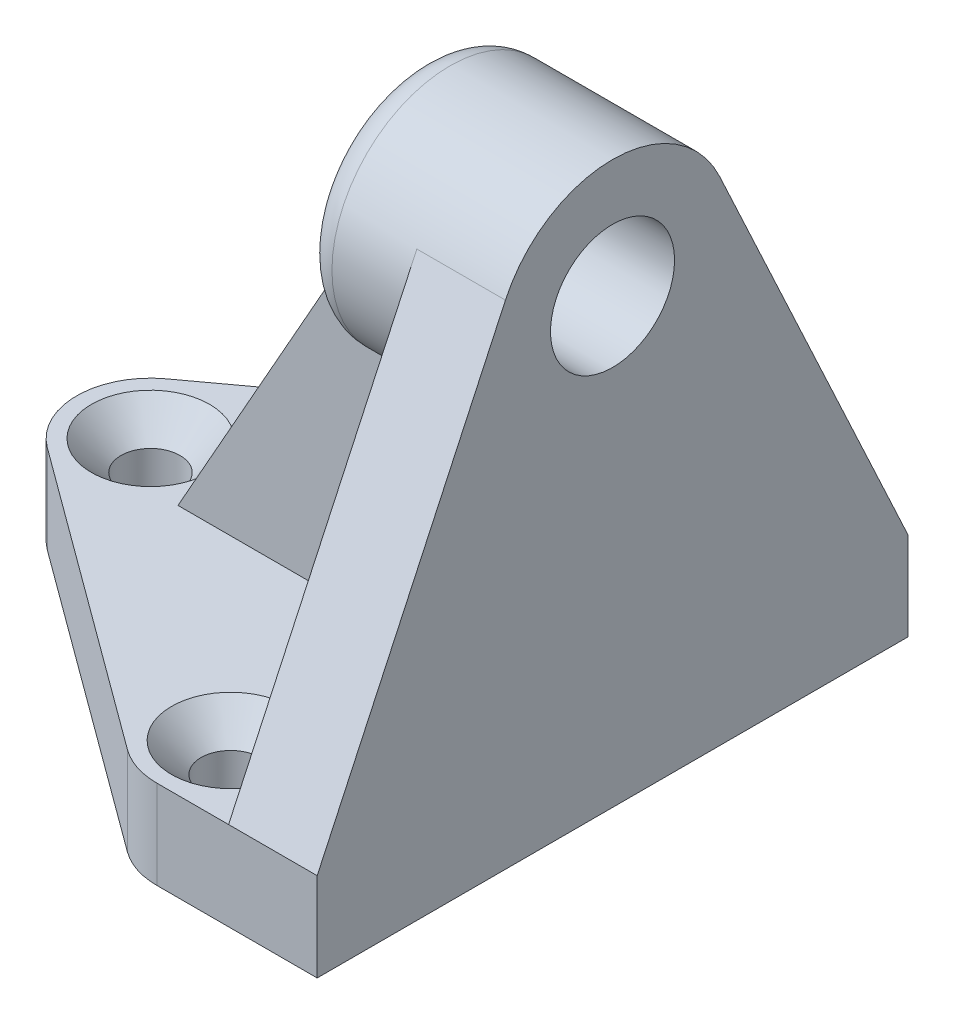
ISO-10303-21;
HEADER;
FILE_DESCRIPTION(('STEP AP214'),'2;1');
FILE_NAME('part.step','',(''),(''),'','','');
FILE_SCHEMA(('AUTOMOTIVE_DESIGN { 1 0 10303 214 1 1 1 1 }'));
ENDSEC;
DATA;
#1=APPLICATION_CONTEXT('core data for automotive mechanical design processes');
#2=APPLICATION_PROTOCOL_DEFINITION('international standard','automotive_design',2000,#1);
#3=PRODUCT_CONTEXT('',#1,'mechanical');
#4=PRODUCT('Part','Part','',(#3));
#5=PRODUCT_RELATED_PRODUCT_CATEGORY('part','',(#4));
#6=PRODUCT_DEFINITION_FORMATION('','',#4);
#7=PRODUCT_DEFINITION_CONTEXT('part definition',#1,'design');
#8=PRODUCT_DEFINITION('design','',#6,#7);
#9=PRODUCT_DEFINITION_SHAPE('','',#8);
#10=(LENGTH_UNIT() NAMED_UNIT(*) SI_UNIT(.MILLI.,.METRE.));
#11=(NAMED_UNIT(*) PLANE_ANGLE_UNIT() SI_UNIT($,.RADIAN.));
#12=(NAMED_UNIT(*) SI_UNIT($,.STERADIAN.) SOLID_ANGLE_UNIT());
#13=UNCERTAINTY_MEASURE_WITH_UNIT(LENGTH_MEASURE(1.E-05),#10,'distance_accuracy_value','');
#14=(GEOMETRIC_REPRESENTATION_CONTEXT(3) GLOBAL_UNCERTAINTY_ASSIGNED_CONTEXT((#13)) GLOBAL_UNIT_ASSIGNED_CONTEXT((#10,
#11,#12)) REPRESENTATION_CONTEXT('',''));
#15=CARTESIAN_POINT('',(0.,0.,0.));
#16=DIRECTION('',(0.,0.,1.));
#17=DIRECTION('',(1.,0.,0.));
#18=AXIS2_PLACEMENT_3D('',#15,#16,#17);
#19=CARTESIAN_POINT('',(-10.8612883527323,6.,15.));
#20=DIRECTION('',(0.,-1.,0.));
#21=DIRECTION('',(0.,0.,-1.));
#22=AXIS2_PLACEMENT_3D('',#19,#20,#21);
#23=PLANE('',#22);
#24=CARTESIAN_POINT('',(-10.8612883527323,6.,-15.));
#25=DIRECTION('',(0.,-1.,0.));
#26=DIRECTION('',(0.,0.,-1.));
#27=AXIS2_PLACEMENT_3D('',#24,#25,#26);
#28=CIRCLE('',#27,4.00000000000004);
#29=CARTESIAN_POINT('',(-10.8612883527323,6.,-19.));
#30=VERTEX_POINT('',#29);
#31=EDGE_CURVE('E372',#30,#30,#28,.T.);
#32=ORIENTED_EDGE('',*,*,#31,.T.);
#33=EDGE_LOOP('',(#32));
#34=FACE_BOUND('',#33,.T.);
#35=CARTESIAN_POINT('',(-31.2870516415162,6.,0.));
#36=DIRECTION('',(0.,-1.,0.));
#37=DIRECTION('',(0.,0.,-1.));
#38=AXIS2_PLACEMENT_3D('',#35,#36,#37);
#39=CIRCLE('',#38,4.00000000000005);
#40=CARTESIAN_POINT('',(-31.2870516415162,6.,-4.00000000000005));
#41=VERTEX_POINT('',#40);
#42=EDGE_CURVE('E376',#41,#41,#39,.T.);
#43=ORIENTED_EDGE('',*,*,#42,.T.);
#44=EDGE_LOOP('',(#43));
#45=FACE_BOUND('',#44,.T.);
#46=CARTESIAN_POINT('',(-10.8612883527323,6.,15.));
#47=DIRECTION('',(0.,-1.,0.));
#48=DIRECTION('',(0.,0.,-1.));
#49=AXIS2_PLACEMENT_3D('',#46,#47,#48);
#50=CIRCLE('',#49,4.00000000000004);
#51=CARTESIAN_POINT('',(-10.8612883527323,6.,11.));
#52=VERTEX_POINT('',#51);
#53=EDGE_CURVE('E380',#52,#52,#50,.T.);
#54=ORIENTED_EDGE('',*,*,#53,.T.);
#55=EDGE_LOOP('',(#54));
#56=FACE_BOUND('',#55,.T.);
#57=DIRECTION('',(1.,0.,0.));
#58=VECTOR('',#57,1.);
#59=CARTESIAN_POINT('',(-26.4270516415162,6.,-3.));
#60=LINE('',#59,#58);
#61=CARTESIAN_POINT('',(-26.4270516415162,6.,-3.));
#62=VERTEX_POINT('',#61);
#63=CARTESIAN_POINT('',(-6.,6.,-3.));
#64=VERTEX_POINT('',#63);
#65=EDGE_CURVE('E205',#62,#64,#60,.T.);
#66=ORIENTED_EDGE('',*,*,#65,.T.);
#67=DIRECTION('',(0.,0.,-1.));
#68=VECTOR('',#67,1.);
#69=CARTESIAN_POINT('',(-6.,6.,20.));
#70=LINE('',#69,#68);
#71=CARTESIAN_POINT('',(-6.,6.,-20.));
#72=VERTEX_POINT('',#71);
#73=EDGE_CURVE('E246',#64,#72,#70,.T.);
#74=ORIENTED_EDGE('',*,*,#73,.T.);
#75=DIRECTION('',(-1.,0.,0.));
#76=VECTOR('',#75,1.);
#77=CARTESIAN_POINT('',(0.,6.,-20.));
#78=LINE('',#77,#76);
#79=CARTESIAN_POINT('',(-10.8612883527323,6.,-20.));
#80=VERTEX_POINT('',#79);
#81=EDGE_CURVE('E292',#72,#80,#78,.T.);
#82=ORIENTED_EDGE('',*,*,#81,.T.);
#83=CARTESIAN_POINT('',(-10.8612883527323,6.,-15.));
#84=DIRECTION('',(0.,1.,0.));
#85=DIRECTION('',(0.,0.,1.));
#86=AXIS2_PLACEMENT_3D('',#83,#84,#85);
#87=CIRCLE('',#86,5.);
#88=CARTESIAN_POINT('',(-13.8208140882384,6.,-19.0300381413675));
#89=VERTEX_POINT('',#88);
#90=EDGE_CURVE('E298',#80,#89,#87,.T.);
#91=ORIENTED_EDGE('',*,*,#90,.T.);
#92=DIRECTION('',(-0.806007628273501,0.,0.591905147101228));
#93=VECTOR('',#92,1.);
#94=CARTESIAN_POINT('',(-34.2465773770223,6.,-4.0300381413675));
#95=LINE('',#94,#93);
#96=CARTESIAN_POINT('',(-34.2465773770223,6.,-4.0300381413675));
#97=VERTEX_POINT('',#96);
#98=EDGE_CURVE('E301',#89,#97,#95,.T.);
#99=ORIENTED_EDGE('',*,*,#98,.T.);
#100=CARTESIAN_POINT('',(-31.2870516415162,6.,0.));
#101=DIRECTION('',(0.,1.,0.));
#102=DIRECTION('',(0.,0.,1.));
#103=AXIS2_PLACEMENT_3D('',#100,#101,#102);
#104=CIRCLE('',#103,5.);
#105=CARTESIAN_POINT('',(-34.2465773770223,6.,4.03003814136751));
#106=VERTEX_POINT('',#105);
#107=EDGE_CURVE('E304',#97,#106,#104,.T.);
#108=ORIENTED_EDGE('',*,*,#107,.T.);
#109=DIRECTION('',(0.806007628273501,0.,0.591905147101228));
#110=VECTOR('',#109,1.);
#111=CARTESIAN_POINT('',(-34.2465773770223,6.,4.03003814136751));
#112=LINE('',#111,#110);
#113=CARTESIAN_POINT('',(-13.8208140882384,6.,19.0300381413675));
#114=VERTEX_POINT('',#113);
#115=EDGE_CURVE('E307',#106,#114,#112,.T.);
#116=ORIENTED_EDGE('',*,*,#115,.T.);
#117=CARTESIAN_POINT('',(-10.8612883527323,6.,15.));
#118=DIRECTION('',(0.,1.,0.));
#119=DIRECTION('',(0.,0.,-1.));
#120=AXIS2_PLACEMENT_3D('',#117,#118,#119);
#121=CIRCLE('',#120,5.);
#122=CARTESIAN_POINT('',(-10.8612883527323,6.,20.));
#123=VERTEX_POINT('',#122);
#124=EDGE_CURVE('E310',#114,#123,#121,.T.);
#125=ORIENTED_EDGE('',*,*,#124,.T.);
#126=DIRECTION('',(1.,0.,0.));
#127=VECTOR('',#126,1.);
#128=CARTESIAN_POINT('',(0.,6.,20.));
#129=LINE('',#128,#127);
#130=CARTESIAN_POINT('',(-6.,6.,20.));
#131=VERTEX_POINT('',#130);
#132=EDGE_CURVE('E288',#123,#131,#129,.T.);
#133=ORIENTED_EDGE('',*,*,#132,.T.);
#134=CARTESIAN_POINT('',(-6.,6.,3.));
#135=VERTEX_POINT('',#134);
#136=EDGE_CURVE('E248',#131,#135,#70,.T.);
#137=ORIENTED_EDGE('',*,*,#136,.T.);
#138=DIRECTION('',(1.,0.,0.));
#139=VECTOR('',#138,1.);
#140=CARTESIAN_POINT('',(-26.4270516415162,6.,3.));
#141=LINE('',#140,#139);
#142=CARTESIAN_POINT('',(-26.4270516415162,6.,3.));
#143=VERTEX_POINT('',#142);
#144=EDGE_CURVE('E66',#143,#135,#141,.T.);
#145=ORIENTED_EDGE('',*,*,#144,.F.);
#146=DIRECTION('',(0.,0.,1.));
#147=VECTOR('',#146,1.);
#148=CARTESIAN_POINT('',(-26.4270516415162,6.,-3.));
#149=LINE('',#148,#147);
#150=EDGE_CURVE('E195',#62,#143,#149,.T.);
#151=ORIENTED_EDGE('',*,*,#150,.F.);
#152=EDGE_LOOP('',(#66,#74,#82,#91,#99,#108,#116,#125,#133,#137,#145,#151));
#153=FACE_BOUND('',#152,.T.);
#154=ADVANCED_FACE('F49',(#34,#45,#56,#153),#23,.F.);
#155=CARTESIAN_POINT('',(-6.,30.,0.));
#156=DIRECTION('',(1.,0.,0.));
#157=DIRECTION('',(0.,0.,-1.));
#158=AXIS2_PLACEMENT_3D('',#155,#156,#157);
#159=PLANE('',#158);
#160=DIRECTION('',(0.,-1.,0.));
#161=VECTOR('',#160,1.);
#162=CARTESIAN_POINT('',(-6.,30.,-3.));
#163=LINE('',#162,#161);
#164=CARTESIAN_POINT('',(-6.,17.734425211105,-3.));
#165=VERTEX_POINT('',#164);
#166=EDGE_CURVE('E230',#165,#64,#163,.T.);
#167=ORIENTED_EDGE('',*,*,#166,.F.);
#168=DIRECTION('',(0.,0.,1.));
#169=VECTOR('',#168,1.);
#170=CARTESIAN_POINT('',(-6.,17.734425211105,0.));
#171=LINE('',#170,#169);
#172=CARTESIAN_POINT('',(-6.,17.734425211105,3.));
#173=VERTEX_POINT('',#172);
#174=EDGE_CURVE('E11',#165,#173,#171,.T.);
#175=ORIENTED_EDGE('',*,*,#174,.T.);
#176=DIRECTION('',(0.,-1.,0.));
#177=VECTOR('',#176,1.);
#178=CARTESIAN_POINT('',(-6.,30.,3.));
#179=LINE('',#178,#177);
#180=EDGE_CURVE('E182',#173,#135,#179,.T.);
#181=ORIENTED_EDGE('',*,*,#180,.T.);
#182=ORIENTED_EDGE('',*,*,#136,.F.);
#183=DIRECTION('',(0.,-0.906541091993844,0.422117576661537));
#184=VECTOR('',#183,1.);
#185=CARTESIAN_POINT('',(-6.,33.3769406132923,7.25232873595075));
#186=LINE('',#185,#184);
#187=CARTESIAN_POINT('',(-6.,33.3769406132923,7.25232873595075));
#188=VERTEX_POINT('',#187);
#189=EDGE_CURVE('E242',#188,#131,#186,.T.);
#190=ORIENTED_EDGE('',*,*,#189,.F.);
#191=CARTESIAN_POINT('',(-6.,30.,0.));
#192=DIRECTION('',(-1.,0.,0.));
#193=DIRECTION('',(0.,0.,1.));
#194=AXIS2_PLACEMENT_3D('',#191,#192,#193);
#195=CIRCLE('',#194,7.99999999999999);
#196=CARTESIAN_POINT('',(-6.,33.3769406132923,-7.25232873595075));
#197=VERTEX_POINT('',#196);
#198=EDGE_CURVE('E233',#197,#188,#195,.T.);
#199=ORIENTED_EDGE('',*,*,#198,.F.);
#200=DIRECTION('',(0.,0.906541091993844,0.422117576661537));
#201=VECTOR('',#200,1.);
#202=CARTESIAN_POINT('',(-6.,33.3769406132923,-7.25232873595075));
#203=LINE('',#202,#201);
#204=EDGE_CURVE('E252',#72,#197,#203,.T.);
#205=ORIENTED_EDGE('',*,*,#204,.F.);
#206=ORIENTED_EDGE('',*,*,#73,.F.);
#207=EDGE_LOOP('',(#167,#175,#181,#182,#190,#199,#205,#206));
#208=FACE_BOUND('',#207,.T.);
#209=ADVANCED_FACE('F461',(#208),#159,.F.);
#210=CARTESIAN_POINT('',(-13.,30.,0.));
#211=DIRECTION('',(-1.,0.,0.));
#212=DIRECTION('',(0.,0.,1.));
#213=AXIS2_PLACEMENT_3D('',#210,#211,#212);
#214=PLANE('',#213);
#215=CARTESIAN_POINT('',(-13.,30.,0.));
#216=DIRECTION('',(-1.,0.,0.));
#217=DIRECTION('',(0.,0.,1.));
#218=AXIS2_PLACEMENT_3D('',#215,#216,#217);
#219=CIRCLE('',#218,6.);
#220=CARTESIAN_POINT('',(-13.,24.8038475772934,3.));
#221=VERTEX_POINT('',#220);
#222=CARTESIAN_POINT('',(-13.,24.8038475772934,-3.));
#223=VERTEX_POINT('',#222);
#224=EDGE_CURVE('E392',#221,#223,#219,.T.);
#225=ORIENTED_EDGE('',*,*,#224,.T.);
#226=DIRECTION('',(0.,1.,0.));
#227=VECTOR('',#226,1.);
#228=CARTESIAN_POINT('',(-13.,30.,-3.));
#229=LINE('',#228,#227);
#230=CARTESIAN_POINT('',(-13.,29.7902541311326,-3.));
#231=VERTEX_POINT('',#230);
#232=EDGE_CURVE('E74',#223,#231,#229,.T.);
#233=ORIENTED_EDGE('',*,*,#232,.T.);
#234=DIRECTION('',(0.,0.,-1.));
#235=VECTOR('',#234,1.);
#236=CARTESIAN_POINT('',(-13.,29.7902541311326,0.));
#237=LINE('',#236,#235);
#238=CARTESIAN_POINT('',(-13.,29.7902541311326,3.));
#239=VERTEX_POINT('',#238);
#240=EDGE_CURVE('E59',#239,#231,#237,.T.);
#241=ORIENTED_EDGE('',*,*,#240,.F.);
#242=DIRECTION('',(0.,1.,0.));
#243=VECTOR('',#242,1.);
#244=CARTESIAN_POINT('',(-13.,30.,3.));
#245=LINE('',#244,#243);
#246=EDGE_CURVE('E221',#221,#239,#245,.T.);
#247=ORIENTED_EDGE('',*,*,#246,.F.);
#248=EDGE_LOOP('',(#225,#233,#241,#247));
#249=FACE_BOUND('',#248,.T.);
#250=ADVANCED_FACE('F468',(#249),#214,.T.);
#251=CARTESIAN_POINT('',(-11.,30.,0.));
#252=DIRECTION('',(-1.,0.,0.));
#253=DIRECTION('',(0.,0.,1.));
#254=AXIS2_PLACEMENT_3D('',#251,#252,#253);
#255=TOROIDAL_SURFACE('',#254,6.,2.);
#256=CARTESIAN_POINT('',(-11.,30.,0.));
#257=DIRECTION('',(-1.,0.,0.));
#258=DIRECTION('',(0.,0.,1.));
#259=AXIS2_PLACEMENT_3D('',#256,#257,#258);
#260=CIRCLE('',#259,8.);
#261=CARTESIAN_POINT('',(-11.,30.,8.));
#262=VERTEX_POINT('',#261);
#263=EDGE_CURVE('E395',#262,#262,#260,.F.);
#264=ORIENTED_EDGE('',*,*,#263,.F.);
#265=EDGE_LOOP('',(#264));
#266=FACE_BOUND('',#265,.T.);
#267=CARTESIAN_POINT('',(-11.5302837937611,30.,0.));
#268=DIRECTION('',(1.,0.,0.));
#269=DIRECTION('',(0.,0.,-1.));
#270=AXIS2_PLACEMENT_3D('',#267,#268,#269);
#271=CIRCLE('',#270,7.9284188077475);
#272=CARTESIAN_POINT('',(-11.5302837937611,22.6610746841895,-3.));
#273=VERTEX_POINT('',#272);
#274=CARTESIAN_POINT('',(-11.5302837937611,22.6610746841895,3.));
#275=VERTEX_POINT('',#274);
#276=EDGE_CURVE('E200',#273,#275,#271,.F.);
#277=ORIENTED_EDGE('',*,*,#276,.F.);
#278=CARTESIAN_POINT('',(-11.861235789251,22.7945092467716,-3.));
#279=CARTESIAN_POINT('',(-11.9623192033776,22.8467587869637,-3.));
#280=CARTESIAN_POINT('',(-12.0588170115225,22.9080491003356,-3.));
#281=CARTESIAN_POINT('',(-12.239920791373,23.0463176561553,-3.));
#282=CARTESIAN_POINT('',(-12.3245102394087,23.1233173408038,-3.));
#283=CARTESIAN_POINT('',(-12.4795153231167,23.2899126004749,-3.));
#284=CARTESIAN_POINT('',(-12.5499797407544,23.3794629436575,-3.));
#285=CARTESIAN_POINT('',(-12.6758968205651,23.5684784426451,-3.));
#286=CARTESIAN_POINT('',(-12.7313517649318,23.66794208798,-3.));
#287=CARTESIAN_POINT('',(-12.8297652546317,23.8806070096931,-3.));
#288=CARTESIAN_POINT('',(-12.8717015104087,23.9942798482262,-3.));
#289=CARTESIAN_POINT('',(-12.937967977474,24.2266318668024,-3.));
#290=CARTESIAN_POINT('',(-12.9622900628024,24.3453133307947,-3.));
#291=CARTESIAN_POINT('',(-12.9954923838156,24.5980248776064,-3.));
#292=CARTESIAN_POINT('',(-13.0023930414501,24.7323141143187,-3.));
#293=CARTESIAN_POINT('',(-12.9961464350172,25.0003748589907,-3.));
#294=CARTESIAN_POINT('',(-12.9829938887939,25.1341462212328,-3.));
#295=CARTESIAN_POINT('',(-12.9351808058057,25.414552635414,-3.));
#296=CARTESIAN_POINT('',(-12.8981025036533,25.5607772469715,-3.));
#297=CARTESIAN_POINT('',(-12.8020918204387,25.8460234128724,-3.));
#298=CARTESIAN_POINT('',(-12.7431253113263,25.9850333302221,-3.));
#299=CARTESIAN_POINT('',(-12.5980816696745,26.2654035867372,-3.));
#300=CARTESIAN_POINT('',(-12.5099570181412,26.4057263090478,-3.));
#301=CARTESIAN_POINT('',(-12.3602840182229,26.6026043339008,-3.));
#302=CARTESIAN_POINT('',(-12.3074935598185,26.6659489906292,-3.));
#303=CARTESIAN_POINT('',(-12.1960670269366,26.7872421336792,-3.));
#304=CARTESIAN_POINT('',(-12.1374349295262,26.845194240038,-3.));
#305=CARTESIAN_POINT('',(-12.0019032751842,26.9655505348394,-3.));
#306=CARTESIAN_POINT('',(-11.9237006805427,27.0265085307263,-3.));
#307=CARTESIAN_POINT('',(-11.7590515498349,27.1359722592255,-3.));
#308=CARTESIAN_POINT('',(-11.6726208257878,27.1845012396234,-3.));
#309=CARTESIAN_POINT('',(-11.5092958412461,27.2577199413555,-3.));
#310=CARTESIAN_POINT('',(-11.4336551120478,27.2851741747413,-3.));
#311=CARTESIAN_POINT('',(-11.2788523710753,27.3270980880797,-3.));
#312=CARTESIAN_POINT('',(-11.1996943375117,27.3415820643396,-3.));
#313=CARTESIAN_POINT('',(-11.0396666774527,27.3560843518458,-3.));
#314=CARTESIAN_POINT('',(-10.9587909316809,27.3560369808088,-3.));
#315=CARTESIAN_POINT('',(-10.7983792007026,27.3413131196877,-3.));
#316=CARTESIAN_POINT('',(-10.7188438866461,27.3266295103347,-3.));
#317=CARTESIAN_POINT('',(-10.568094656578,27.2854963485297,-3.));
#318=CARTESIAN_POINT('',(-10.4966678097853,27.2598059005786,-3.));
#319=CARTESIAN_POINT('',(-10.3580995795439,27.1987833045736,-3.));
#320=CARTESIAN_POINT('',(-10.2909605419162,27.1634459335996,-3.));
#321=CARTESIAN_POINT('',(-10.1222106933377,27.06114109854,-3.));
#322=CARTESIAN_POINT('',(-10.0243506841569,26.9879793313313,-3.));
#323=CARTESIAN_POINT('',(-9.84131955467087,26.827134059973,-3.));
#324=CARTESIAN_POINT('',(-9.75618549008205,26.7394096593078,-3.));
#325=CARTESIAN_POINT('',(-9.57405244583853,26.523987225174,-3.));
#326=CARTESIAN_POINT('',(-9.48167763293907,26.392370773904,-3.));
#327=CARTESIAN_POINT('',(-9.31967946905861,26.1159483800208,-3.));
#328=CARTESIAN_POINT('',(-9.25005871913124,25.9711409319411,-3.));
#329=CARTESIAN_POINT('',(-9.13457148779452,25.6709876084404,-3.));
#330=CARTESIAN_POINT('',(-9.08889609273097,25.5155678216416,-3.));
#331=CARTESIAN_POINT('',(-9.02431185205182,25.1992234422896,-3.));
#332=CARTESIAN_POINT('',(-9.00539707930456,25.0383000767972,-3.));
#333=CARTESIAN_POINT('',(-8.99660949287456,24.7159375897862,-3.));
#334=CARTESIAN_POINT('',(-9.00666714905949,24.5545006302594,-3.));
#335=CARTESIAN_POINT('',(-9.05754894071875,24.2364674822837,-3.));
#336=CARTESIAN_POINT('',(-9.09835223290371,24.0798680891563,-3.));
#337=CARTESIAN_POINT('',(-9.20461256792815,23.7964258070394,-3.));
#338=CARTESIAN_POINT('',(-9.26654101126687,23.6682632486085,-3.));
#339=CARTESIAN_POINT('',(-9.41407342760088,23.4263540293851,-3.));
#340=CARTESIAN_POINT('',(-9.49965348883765,23.3125929771653,-3.));
#341=CARTESIAN_POINT('',(-9.67988329245463,23.1183462818847,-3.));
#342=CARTESIAN_POINT('',(-9.77195369467014,23.0354631000641,-3.));
#343=CARTESIAN_POINT('',(-9.96992695678342,22.8882976013662,-3.));
#344=CARTESIAN_POINT('',(-10.0758199717786,22.8240021495129,-3.));
#345=CARTESIAN_POINT('',(-10.2874439529942,22.7220353114017,-3.));
#346=CARTESIAN_POINT('',(-10.3922412414086,22.6824196942582,-3.));
#347=CARTESIAN_POINT('',(-10.6072256587107,22.6224372505113,-3.));
#348=CARTESIAN_POINT('',(-10.7174117144998,22.6020666078208,-3.));
#349=CARTESIAN_POINT('',(-10.9338337111218,22.5819651643408,-3.));
#350=CARTESIAN_POINT('',(-11.0399766666559,22.5812150696034,-3.));
#351=CARTESIAN_POINT('',(-11.2507649871095,22.59780178098,-3.));
#352=CARTESIAN_POINT('',(-11.3554117837475,22.6151199328209,-3.));
#353=CARTESIAN_POINT('',(-11.5276838082517,22.6588542563716,-3.));
#354=CARTESIAN_POINT('',(-11.5965231723444,22.6806420694349,-3.));
#355=CARTESIAN_POINT('',(-11.7312675484523,22.7319126261557,-3.));
#356=CARTESIAN_POINT('',(-11.7971725935773,22.7613952829615,-3.));
#357=CARTESIAN_POINT('',(-11.861235789251,22.7945092467716,-3.));
#358=B_SPLINE_CURVE_WITH_KNOTS('',3,(#278,#279,#280,#281,#282,#283,#284,#285,#286,#287,#288,
#289,#290,#291,#292,#293,#294,#295,#296,#297,#298,#299,#300,#301,#302,#303,#304,#305,#306,#307,
#308,#309,#310,#311,#312,#313,#314,#315,#316,#317,#318,#319,#320,#321,#322,#323,#324,#325,#326,
#327,#328,#329,#330,#331,#332,#333,#334,#335,#336,#337,#338,#339,#340,#341,#342,#343,#344,#345,
#346,#347,#348,#349,#350,#351,#352,#353,#354,#355,#356,#357),.UNSPECIFIED.,.T.,.F.,(4,2,2,2,2,2,
2,2,2,2,2,2,2,2,2,2,2,2,2,2,2,2,2,2,2,2,2,2,2,2,2,2,2,2,2,2,2,2,2,4),(0.,0.341082634042776,
0.68263397484685,1.02298460833743,1.36328346232843,1.72528109436704,2.087445620873,
2.48921601915108,2.89109226488007,3.34176807126643,3.79314954250234,4.28753105367206,
4.53460233901777,4.78150654960585,5.07803507370419,5.37400483885166,5.61444098456028,
5.85461178509525,6.09586818338414,6.33724198941945,6.56412824779699,6.79113758863312,
7.15564110474831,7.52118613902019,8.00112370161543,8.48111610747457,8.96488273430926,
9.44854219631143,9.93104190503539,10.413214808255,10.8377709213133,11.2618993689812,
11.6315168427333,12.0008724851369,12.3352619260114,12.6695850468572,12.9865034291092,
13.3030949375122,13.5192638346241,13.7354302919447),.UNSPECIFIED.);
#359=EDGE_CURVE('E419',#273,#223,#358,.T.);
#360=ORIENTED_EDGE('',*,*,#359,.T.);
#361=ORIENTED_EDGE('',*,*,#224,.F.);
#362=CARTESIAN_POINT('',(-11.861235789251,22.7945092467716,3.));
#363=CARTESIAN_POINT('',(-11.9623192033776,22.8467587869637,3.));
#364=CARTESIAN_POINT('',(-12.0588170115225,22.9080491003356,3.));
#365=CARTESIAN_POINT('',(-12.2399207913731,23.0463176561553,3.));
#366=CARTESIAN_POINT('',(-12.3245102394087,23.1233173408038,3.));
#367=CARTESIAN_POINT('',(-12.4795153231167,23.2899126004749,3.));
#368=CARTESIAN_POINT('',(-12.5499797407544,23.3794629436575,3.));
#369=CARTESIAN_POINT('',(-12.6758968205651,23.5684784426451,3.));
#370=CARTESIAN_POINT('',(-12.7313517649318,23.66794208798,3.));
#371=CARTESIAN_POINT('',(-12.8297652546317,23.8806070096931,3.));
#372=CARTESIAN_POINT('',(-12.8717015104087,23.9942798482262,3.));
#373=CARTESIAN_POINT('',(-12.937967977474,24.2266318668024,3.));
#374=CARTESIAN_POINT('',(-12.9622900628024,24.3453133307947,3.));
#375=CARTESIAN_POINT('',(-12.9954923838156,24.5980248776064,3.));
#376=CARTESIAN_POINT('',(-13.0023930414501,24.7323141143187,3.));
#377=CARTESIAN_POINT('',(-12.9961464350172,25.0003748589907,3.));
#378=CARTESIAN_POINT('',(-12.9829938887939,25.1341462212328,3.));
#379=CARTESIAN_POINT('',(-12.9351808058057,25.414552635414,3.));
#380=CARTESIAN_POINT('',(-12.8981025036533,25.5607772469715,3.));
#381=CARTESIAN_POINT('',(-12.8020918204387,25.8460234128724,3.));
#382=CARTESIAN_POINT('',(-12.7431253113263,25.9850333302221,3.));
#383=CARTESIAN_POINT('',(-12.5980816696745,26.2654035867372,3.));
#384=CARTESIAN_POINT('',(-12.5099570181412,26.4057263090478,3.));
#385=CARTESIAN_POINT('',(-12.3602840182229,26.6026043339008,3.));
#386=CARTESIAN_POINT('',(-12.3074935598185,26.6659489906292,3.));
#387=CARTESIAN_POINT('',(-12.1960670269366,26.7872421336792,3.));
#388=CARTESIAN_POINT('',(-12.1374349295262,26.845194240038,3.));
#389=CARTESIAN_POINT('',(-12.0019032751842,26.9655505348394,3.));
#390=CARTESIAN_POINT('',(-11.9237006805427,27.0265085307263,3.));
#391=CARTESIAN_POINT('',(-11.7590515498349,27.1359722592255,3.));
#392=CARTESIAN_POINT('',(-11.6726208257878,27.1845012396234,3.));
#393=CARTESIAN_POINT('',(-11.5092958412461,27.2577199413555,3.));
#394=CARTESIAN_POINT('',(-11.4336551120478,27.2851741747413,3.));
#395=CARTESIAN_POINT('',(-11.2788523710753,27.3270980880797,3.));
#396=CARTESIAN_POINT('',(-11.1996943375117,27.3415820643396,3.));
#397=CARTESIAN_POINT('',(-11.0396666774527,27.3560843518458,3.));
#398=CARTESIAN_POINT('',(-10.9587909316809,27.3560369808088,3.));
#399=CARTESIAN_POINT('',(-10.7983792007026,27.3413131196877,3.));
#400=CARTESIAN_POINT('',(-10.7188438866461,27.3266295103347,3.));
#401=CARTESIAN_POINT('',(-10.568094656578,27.2854963485297,3.));
#402=CARTESIAN_POINT('',(-10.4966678097853,27.2598059005786,3.));
#403=CARTESIAN_POINT('',(-10.3580995795439,27.1987833045736,3.));
#404=CARTESIAN_POINT('',(-10.2909605419162,27.1634459335996,3.));
#405=CARTESIAN_POINT('',(-10.1222106933377,27.06114109854,3.));
#406=CARTESIAN_POINT('',(-10.0243506841569,26.9879793313313,3.));
#407=CARTESIAN_POINT('',(-9.84131955467087,26.827134059973,3.));
#408=CARTESIAN_POINT('',(-9.75618549008204,26.7394096593078,3.));
#409=CARTESIAN_POINT('',(-9.57405244583852,26.523987225174,3.));
#410=CARTESIAN_POINT('',(-9.48167763293906,26.392370773904,3.));
#411=CARTESIAN_POINT('',(-9.3196794690586,26.1159483800207,3.));
#412=CARTESIAN_POINT('',(-9.25005871913124,25.971140931941,3.));
#413=CARTESIAN_POINT('',(-9.13457148779452,25.6709876084404,3.));
#414=CARTESIAN_POINT('',(-9.08889609273097,25.5155678216416,3.));
#415=CARTESIAN_POINT('',(-9.02431185205181,25.1992234422896,3.));
#416=CARTESIAN_POINT('',(-9.00539707930456,25.0383000767972,3.));
#417=CARTESIAN_POINT('',(-8.99660949287456,24.7159375897862,3.));
#418=CARTESIAN_POINT('',(-9.00666714905949,24.5545006302594,3.));
#419=CARTESIAN_POINT('',(-9.05754894071876,24.2364674822836,3.));
#420=CARTESIAN_POINT('',(-9.09835223290371,24.0798680891563,3.));
#421=CARTESIAN_POINT('',(-9.20461256792816,23.7964258070394,3.));
#422=CARTESIAN_POINT('',(-9.26654101126688,23.6682632486085,3.));
#423=CARTESIAN_POINT('',(-9.41407342760088,23.4263540293851,3.));
#424=CARTESIAN_POINT('',(-9.49965348883766,23.3125929771653,3.));
#425=CARTESIAN_POINT('',(-9.67988329245463,23.1183462818847,3.));
#426=CARTESIAN_POINT('',(-9.77195369467014,23.0354631000641,3.));
#427=CARTESIAN_POINT('',(-9.96992695678342,22.8882976013662,3.));
#428=CARTESIAN_POINT('',(-10.0758199717786,22.8240021495129,3.));
#429=CARTESIAN_POINT('',(-10.2874439529942,22.7220353114017,3.));
#430=CARTESIAN_POINT('',(-10.3922412414086,22.6824196942582,3.));
#431=CARTESIAN_POINT('',(-10.6072256587107,22.6224372505113,3.));
#432=CARTESIAN_POINT('',(-10.7174117144998,22.6020666078208,3.));
#433=CARTESIAN_POINT('',(-10.9338337111218,22.5819651643408,3.));
#434=CARTESIAN_POINT('',(-11.0399766666559,22.5812150696034,3.));
#435=CARTESIAN_POINT('',(-11.2507649871095,22.59780178098,3.));
#436=CARTESIAN_POINT('',(-11.3554117837475,22.6151199328209,3.));
#437=CARTESIAN_POINT('',(-11.5276838082517,22.6588542563716,3.));
#438=CARTESIAN_POINT('',(-11.5965231723444,22.6806420694349,3.));
#439=CARTESIAN_POINT('',(-11.7312675484523,22.7319126261557,3.));
#440=CARTESIAN_POINT('',(-11.7971725935773,22.7613952829615,3.));
#441=CARTESIAN_POINT('',(-11.861235789251,22.7945092467716,3.));
#442=B_SPLINE_CURVE_WITH_KNOTS('',3,(#362,#363,#364,#365,#366,#367,#368,#369,#370,#371,#372,
#373,#374,#375,#376,#377,#378,#379,#380,#381,#382,#383,#384,#385,#386,#387,#388,#389,#390,#391,
#392,#393,#394,#395,#396,#397,#398,#399,#400,#401,#402,#403,#404,#405,#406,#407,#408,#409,#410,
#411,#412,#413,#414,#415,#416,#417,#418,#419,#420,#421,#422,#423,#424,#425,#426,#427,#428,#429,
#430,#431,#432,#433,#434,#435,#436,#437,#438,#439,#440,#441),.UNSPECIFIED.,.T.,.F.,(4,2,2,2,2,2,
2,2,2,2,2,2,2,2,2,2,2,2,2,2,2,2,2,2,2,2,2,2,2,2,2,2,2,2,2,2,2,2,2,4),(0.,0.341082634042779,
0.682633974846849,1.02298460833742,1.36328346232843,1.72528109436704,2.087445620873,
2.48921601915108,2.89109226488007,3.34176807126643,3.79314954250235,4.28753105367206,
4.53460233901777,4.78150654960585,5.07803507370419,5.37400483885166,5.61444098456028,
5.85461178509525,6.09586818338414,6.33724198941945,6.564128247797,6.79113758863312,
7.15564110474832,7.5211861390202,8.00112370161544,8.48111610747457,8.96488273430926,
9.44854219631143,9.9310419050354,10.413214808255,10.8377709213133,11.2618993689812,
11.6315168427333,12.0008724851369,12.3352619260114,12.6695850468572,12.9865034291092,
13.3030949375122,13.5192638346241,13.7354302919447),.UNSPECIFIED.);
#443=EDGE_CURVE('E399',#275,#221,#442,.T.);
#444=ORIENTED_EDGE('',*,*,#443,.F.);
#445=EDGE_LOOP('',(#277,#360,#361,#444));
#446=FACE_BOUND('',#445,.T.);
#447=ADVANCED_FACE('F51',(#266,#446),#255,.T.);
#448=CARTESIAN_POINT('',(-10.8612883527323,0.,15.));
#449=DIRECTION('',(0.,-1.,0.));
#450=DIRECTION('',(0.,0.,-1.));
#451=AXIS2_PLACEMENT_3D('',#448,#449,#450);
#452=PLANE('',#451);
#453=CARTESIAN_POINT('',(-31.2870516415162,0.,0.));
#454=DIRECTION('',(0.,1.,0.));
#455=DIRECTION('',(0.,0.,1.));
#456=AXIS2_PLACEMENT_3D('',#453,#454,#455);
#457=CIRCLE('',#456,2.);
#458=CARTESIAN_POINT('',(-31.2870516415162,0.,2.00000000000001));
#459=VERTEX_POINT('',#458);
#460=EDGE_CURVE('E279',#459,#459,#457,.T.);
#461=ORIENTED_EDGE('',*,*,#460,.T.);
#462=EDGE_LOOP('',(#461));
#463=FACE_BOUND('',#462,.T.);
#464=DIRECTION('',(1.,0.,0.));
#465=VECTOR('',#464,1.);
#466=CARTESIAN_POINT('',(0.,0.,20.));
#467=LINE('',#466,#465);
#468=CARTESIAN_POINT('',(-10.8612883527323,0.,20.));
#469=VERTEX_POINT('',#468);
#470=CARTESIAN_POINT('',(0.,0.,20.));
#471=VERTEX_POINT('',#470);
#472=EDGE_CURVE('E287',#469,#471,#467,.T.);
#473=ORIENTED_EDGE('',*,*,#472,.F.);
#474=CARTESIAN_POINT('',(-10.8612883527323,0.,15.));
#475=DIRECTION('',(0.,1.,0.));
#476=DIRECTION('',(0.,0.,-1.));
#477=AXIS2_PLACEMENT_3D('',#474,#475,#476);
#478=CIRCLE('',#477,5.);
#479=CARTESIAN_POINT('',(-13.8208140882384,0.,19.0300381413675));
#480=VERTEX_POINT('',#479);
#481=EDGE_CURVE('E293',#480,#469,#478,.T.);
#482=ORIENTED_EDGE('',*,*,#481,.F.);
#483=DIRECTION('',(0.806007628273501,0.,0.591905147101228));
#484=VECTOR('',#483,1.);
#485=CARTESIAN_POINT('',(-34.2465773770223,0.,4.03003814136751));
#486=LINE('',#485,#484);
#487=CARTESIAN_POINT('',(-34.2465773770223,0.,4.03003814136751));
#488=VERTEX_POINT('',#487);
#489=EDGE_CURVE('E332',#488,#480,#486,.T.);
#490=ORIENTED_EDGE('',*,*,#489,.F.);
#491=CARTESIAN_POINT('',(-31.2870516415162,0.,0.));
#492=DIRECTION('',(0.,1.,0.));
#493=DIRECTION('',(0.,0.,1.));
#494=AXIS2_PLACEMENT_3D('',#491,#492,#493);
#495=CIRCLE('',#494,5.);
#496=CARTESIAN_POINT('',(-34.2465773770223,0.,-4.0300381413675));
#497=VERTEX_POINT('',#496);
#498=EDGE_CURVE('E329',#497,#488,#495,.T.);
#499=ORIENTED_EDGE('',*,*,#498,.F.);
#500=DIRECTION('',(-0.806007628273501,0.,0.591905147101228));
#501=VECTOR('',#500,1.);
#502=CARTESIAN_POINT('',(-34.2465773770223,0.,-4.0300381413675));
#503=LINE('',#502,#501);
#504=CARTESIAN_POINT('',(-13.8208140882384,0.,-19.0300381413675));
#505=VERTEX_POINT('',#504);
#506=EDGE_CURVE('E326',#505,#497,#503,.T.);
#507=ORIENTED_EDGE('',*,*,#506,.F.);
#508=CARTESIAN_POINT('',(-10.8612883527323,0.,-15.));
#509=DIRECTION('',(0.,1.,0.));
#510=DIRECTION('',(0.,0.,1.));
#511=AXIS2_PLACEMENT_3D('',#508,#509,#510);
#512=CIRCLE('',#511,5.);
#513=CARTESIAN_POINT('',(-10.8612883527323,0.,-20.));
#514=VERTEX_POINT('',#513);
#515=EDGE_CURVE('E323',#514,#505,#512,.T.);
#516=ORIENTED_EDGE('',*,*,#515,.F.);
#517=DIRECTION('',(-1.,0.,0.));
#518=VECTOR('',#517,1.);
#519=CARTESIAN_POINT('',(0.,0.,-20.));
#520=LINE('',#519,#518);
#521=CARTESIAN_POINT('',(0.,0.,-20.));
#522=VERTEX_POINT('',#521);
#523=EDGE_CURVE('E320',#522,#514,#520,.T.);
#524=ORIENTED_EDGE('',*,*,#523,.F.);
#525=DIRECTION('',(0.,0.,-1.));
#526=VECTOR('',#525,1.);
#527=CARTESIAN_POINT('',(0.,0.,20.));
#528=LINE('',#527,#526);
#529=EDGE_CURVE('E317',#471,#522,#528,.T.);
#530=ORIENTED_EDGE('',*,*,#529,.F.);
#531=EDGE_LOOP('',(#473,#482,#490,#499,#507,#516,#524,#530));
#532=FACE_BOUND('',#531,.T.);
#533=CARTESIAN_POINT('',(-10.8612883527323,0.,-15.));
#534=DIRECTION('',(0.,1.,0.));
#535=DIRECTION('',(0.,0.,1.));
#536=AXIS2_PLACEMENT_3D('',#533,#534,#535);
#537=CIRCLE('',#536,2.);
#538=CARTESIAN_POINT('',(-10.8612883527323,0.,-13.));
#539=VERTEX_POINT('',#538);
#540=EDGE_CURVE('E283',#539,#539,#537,.T.);
#541=ORIENTED_EDGE('',*,*,#540,.T.);
#542=EDGE_LOOP('',(#541));
#543=FACE_BOUND('',#542,.T.);
#544=CARTESIAN_POINT('',(-10.8612883527323,0.,15.));
#545=DIRECTION('',(0.,1.,0.));
#546=DIRECTION('',(0.,0.,1.));
#547=AXIS2_PLACEMENT_3D('',#544,#545,#546);
#548=CIRCLE('',#547,2.);
#549=CARTESIAN_POINT('',(-10.8612883527323,0.,17.));
#550=VERTEX_POINT('',#549);
#551=EDGE_CURVE('E270',#550,#550,#548,.T.);
#552=ORIENTED_EDGE('',*,*,#551,.T.);
#553=EDGE_LOOP('',(#552));
#554=FACE_BOUND('',#553,.T.);
#555=ADVANCED_FACE('F475',(#463,#532,#543,#554),#452,.T.);
#556=CARTESIAN_POINT('',(0.,6.,20.));
#557=DIRECTION('',(0.,0.,-1.));
#558=DIRECTION('',(-1.,0.,0.));
#559=AXIS2_PLACEMENT_3D('',#556,#557,#558);
#560=PLANE('',#559);
#561=ORIENTED_EDGE('',*,*,#472,.T.);
#562=DIRECTION('',(0.,-1.,0.));
#563=VECTOR('',#562,1.);
#564=CARTESIAN_POINT('',(0.,6.,20.));
#565=LINE('',#564,#563);
#566=CARTESIAN_POINT('',(0.,6.,20.));
#567=VERTEX_POINT('',#566);
#568=EDGE_CURVE('E364',#567,#471,#565,.T.);
#569=ORIENTED_EDGE('',*,*,#568,.F.);
#570=DIRECTION('',(1.,0.,0.));
#571=VECTOR('',#570,1.);
#572=CARTESIAN_POINT('',(-6.,6.,20.));
#573=LINE('',#572,#571);
#574=EDGE_CURVE('E271',#131,#567,#573,.T.);
#575=ORIENTED_EDGE('',*,*,#574,.F.);
#576=ORIENTED_EDGE('',*,*,#132,.F.);
#577=DIRECTION('',(0.,-1.,0.));
#578=VECTOR('',#577,1.);
#579=CARTESIAN_POINT('',(-10.8612883527323,6.,20.));
#580=LINE('',#579,#578);
#581=EDGE_CURVE('E313',#123,#469,#580,.T.);
#582=ORIENTED_EDGE('',*,*,#581,.T.);
#583=EDGE_LOOP('',(#561,#569,#575,#576,#582));
#584=FACE_BOUND('',#583,.T.);
#585=ADVANCED_FACE('F478',(#584),#560,.F.);
#586=CARTESIAN_POINT('',(0.,6.,20.));
#587=DIRECTION('',(-1.,0.,0.));
#588=DIRECTION('',(0.,0.,1.));
#589=AXIS2_PLACEMENT_3D('',#586,#587,#588);
#590=PLANE('',#589);
#591=ORIENTED_EDGE('',*,*,#529,.T.);
#592=DIRECTION('',(0.,-1.,0.));
#593=VECTOR('',#592,1.);
#594=CARTESIAN_POINT('',(0.,6.,-20.));
#595=LINE('',#594,#593);
#596=CARTESIAN_POINT('',(0.,6.,-20.));
#597=VERTEX_POINT('',#596);
#598=EDGE_CURVE('E360',#597,#522,#595,.T.);
#599=ORIENTED_EDGE('',*,*,#598,.F.);
#600=DIRECTION('',(0.,0.906541091993844,0.422117576661537));
#601=VECTOR('',#600,1.);
#602=CARTESIAN_POINT('',(0.,33.3769406132923,-7.25232873595075));
#603=LINE('',#602,#601);
#604=CARTESIAN_POINT('',(0.,33.3769406132923,-7.25232873595075));
#605=VERTEX_POINT('',#604);
#606=EDGE_CURVE('E247',#597,#605,#603,.T.);
#607=ORIENTED_EDGE('',*,*,#606,.T.);
#608=CARTESIAN_POINT('',(0.,30.,0.));
#609=DIRECTION('',(1.,0.,0.));
#610=DIRECTION('',(0.,0.,-1.));
#611=AXIS2_PLACEMENT_3D('',#608,#609,#610);
#612=CIRCLE('',#611,8.);
#613=CARTESIAN_POINT('',(0.,33.3769406132923,7.25232873595075));
#614=VERTEX_POINT('',#613);
#615=EDGE_CURVE('E241',#605,#614,#612,.T.);
#616=ORIENTED_EDGE('',*,*,#615,.T.);
#617=DIRECTION('',(0.,-0.906541091993844,0.422117576661537));
#618=VECTOR('',#617,1.);
#619=CARTESIAN_POINT('',(0.,33.3769406132923,7.25232873595075));
#620=LINE('',#619,#618);
#621=EDGE_CURVE('E260',#614,#567,#620,.T.);
#622=ORIENTED_EDGE('',*,*,#621,.T.);
#623=ORIENTED_EDGE('',*,*,#568,.T.);
#624=EDGE_LOOP('',(#591,#599,#607,#616,#622,#623));
#625=FACE_BOUND('',#624,.T.);
#626=CARTESIAN_POINT('',(0.,30.,0.));
#627=DIRECTION('',(1.,0.,0.));
#628=DIRECTION('',(0.,0.,-1.));
#629=AXIS2_PLACEMENT_3D('',#626,#627,#628);
#630=CIRCLE('',#629,4.2);
#631=CARTESIAN_POINT('',(0.,30.,-4.2));
#632=VERTEX_POINT('',#631);
#633=EDGE_CURVE('E237',#632,#632,#630,.T.);
#634=ORIENTED_EDGE('',*,*,#633,.F.);
#635=EDGE_LOOP('',(#634));
#636=FACE_BOUND('',#635,.T.);
#637=ADVANCED_FACE('F503',(#625,#636),#590,.F.);
#638=CARTESIAN_POINT('',(0.,6.,-20.));
#639=DIRECTION('',(0.,0.,1.));
#640=DIRECTION('',(1.,0.,0.));
#641=AXIS2_PLACEMENT_3D('',#638,#639,#640);
#642=PLANE('',#641);
#643=ORIENTED_EDGE('',*,*,#523,.T.);
#644=DIRECTION('',(0.,-1.,0.));
#645=VECTOR('',#644,1.);
#646=CARTESIAN_POINT('',(-10.8612883527323,6.,-20.));
#647=LINE('',#646,#645);
#648=EDGE_CURVE('E356',#80,#514,#647,.T.);
#649=ORIENTED_EDGE('',*,*,#648,.F.);
#650=ORIENTED_EDGE('',*,*,#81,.F.);
#651=EDGE_CURVE('E294',#597,#72,#78,.T.);
#652=ORIENTED_EDGE('',*,*,#651,.F.);
#653=ORIENTED_EDGE('',*,*,#598,.T.);
#654=EDGE_LOOP('',(#643,#649,#650,#652,#653));
#655=FACE_BOUND('',#654,.T.);
#656=ADVANCED_FACE('F499',(#655),#642,.F.);
#657=CARTESIAN_POINT('',(-10.8612883527323,6.,-15.));
#658=DIRECTION('',(0.,-1.,0.));
#659=DIRECTION('',(0.,0.,-1.));
#660=AXIS2_PLACEMENT_3D('',#657,#658,#659);
#661=CYLINDRICAL_SURFACE('',#660,5.);
#662=ORIENTED_EDGE('',*,*,#515,.T.);
#663=DIRECTION('',(0.,-1.,0.));
#664=VECTOR('',#663,1.);
#665=CARTESIAN_POINT('',(-13.8208140882384,6.,-19.0300381413675));
#666=LINE('',#665,#664);
#667=EDGE_CURVE('E352',#89,#505,#666,.T.);
#668=ORIENTED_EDGE('',*,*,#667,.F.);
#669=ORIENTED_EDGE('',*,*,#90,.F.);
#670=ORIENTED_EDGE('',*,*,#648,.T.);
#671=EDGE_LOOP('',(#662,#668,#669,#670));
#672=FACE_BOUND('',#671,.T.);
#673=ADVANCED_FACE('F495',(#672),#661,.T.);
#674=CARTESIAN_POINT('',(-34.2465773770223,6.,-4.0300381413675));
#675=DIRECTION('',(0.591905147101228,0.,0.8060076282735));
#676=DIRECTION('',(0.806007628273501,0.,-0.591905147101228));
#677=AXIS2_PLACEMENT_3D('',#674,#675,#676);
#678=PLANE('',#677);
#679=ORIENTED_EDGE('',*,*,#506,.T.);
#680=DIRECTION('',(0.,-1.,0.));
#681=VECTOR('',#680,1.);
#682=CARTESIAN_POINT('',(-34.2465773770223,6.,-4.0300381413675));
#683=LINE('',#682,#681);
#684=EDGE_CURVE('E348',#97,#497,#683,.T.);
#685=ORIENTED_EDGE('',*,*,#684,.F.);
#686=ORIENTED_EDGE('',*,*,#98,.F.);
#687=ORIENTED_EDGE('',*,*,#667,.T.);
#688=EDGE_LOOP('',(#679,#685,#686,#687));
#689=FACE_BOUND('',#688,.T.);
#690=ADVANCED_FACE('F491',(#689),#678,.F.);
#691=CARTESIAN_POINT('',(-31.2870516415162,6.,0.));
#692=DIRECTION('',(0.,-1.,0.));
#693=DIRECTION('',(0.,0.,-1.));
#694=AXIS2_PLACEMENT_3D('',#691,#692,#693);
#695=CYLINDRICAL_SURFACE('',#694,5.);
#696=ORIENTED_EDGE('',*,*,#498,.T.);
#697=DIRECTION('',(0.,-1.,0.));
#698=VECTOR('',#697,1.);
#699=CARTESIAN_POINT('',(-34.2465773770223,6.,4.03003814136751));
#700=LINE('',#699,#698);
#701=EDGE_CURVE('E344',#106,#488,#700,.T.);
#702=ORIENTED_EDGE('',*,*,#701,.F.);
#703=ORIENTED_EDGE('',*,*,#107,.F.);
#704=ORIENTED_EDGE('',*,*,#684,.T.);
#705=EDGE_LOOP('',(#696,#702,#703,#704));
#706=FACE_BOUND('',#705,.T.);
#707=ADVANCED_FACE('F487',(#706),#695,.T.);
#708=CARTESIAN_POINT('',(-34.2465773770223,6.,4.03003814136751));
#709=DIRECTION('',(0.591905147101228,0.,-0.806007628273501));
#710=DIRECTION('',(-0.806007628273501,0.,-0.591905147101228));
#711=AXIS2_PLACEMENT_3D('',#708,#709,#710);
#712=PLANE('',#711);
#713=ORIENTED_EDGE('',*,*,#489,.T.);
#714=DIRECTION('',(0.,-1.,0.));
#715=VECTOR('',#714,1.);
#716=CARTESIAN_POINT('',(-13.8208140882384,6.,19.0300381413675));
#717=LINE('',#716,#715);
#718=EDGE_CURVE('E340',#114,#480,#717,.T.);
#719=ORIENTED_EDGE('',*,*,#718,.F.);
#720=ORIENTED_EDGE('',*,*,#115,.F.);
#721=ORIENTED_EDGE('',*,*,#701,.T.);
#722=EDGE_LOOP('',(#713,#719,#720,#721));
#723=FACE_BOUND('',#722,.T.);
#724=ADVANCED_FACE('F483',(#723),#712,.F.);
#725=CARTESIAN_POINT('',(-10.8612883527323,6.,15.));
#726=DIRECTION('',(0.,-1.,0.));
#727=DIRECTION('',(0.,0.,-1.));
#728=AXIS2_PLACEMENT_3D('',#725,#726,#727);
#729=CYLINDRICAL_SURFACE('',#728,5.);
#730=ORIENTED_EDGE('',*,*,#481,.T.);
#731=ORIENTED_EDGE('',*,*,#581,.F.);
#732=ORIENTED_EDGE('',*,*,#124,.F.);
#733=ORIENTED_EDGE('',*,*,#718,.T.);
#734=EDGE_LOOP('',(#730,#731,#732,#733));
#735=FACE_BOUND('',#734,.T.);
#736=ADVANCED_FACE('F480',(#735),#729,.T.);
#737=CARTESIAN_POINT('',(-10.8612883527323,6.,-15.));
#738=DIRECTION('',(0.,-1.,0.));
#739=DIRECTION('',(0.,0.,-1.));
#740=AXIS2_PLACEMENT_3D('',#737,#738,#739);
#741=CYLINDRICAL_SURFACE('',#740,2.);
#742=CARTESIAN_POINT('',(-10.8612883527323,3.99999999999997,-15.));
#743=DIRECTION('',(0.,-1.,0.));
#744=DIRECTION('',(0.,0.,-1.));
#745=AXIS2_PLACEMENT_3D('',#742,#743,#744);
#746=CIRCLE('',#745,2.);
#747=CARTESIAN_POINT('',(-10.8612883527323,3.99999999999997,-17.));
#748=VERTEX_POINT('',#747);
#749=EDGE_CURVE('E388',#748,#748,#746,.F.);
#750=ORIENTED_EDGE('',*,*,#749,.T.);
#751=EDGE_LOOP('',(#750));
#752=FACE_BOUND('',#751,.T.);
#753=ORIENTED_EDGE('',*,*,#540,.F.);
#754=EDGE_LOOP('',(#753));
#755=FACE_BOUND('',#754,.T.);
#756=ADVANCED_FACE('F473',(#752,#755),#741,.F.);
#757=CARTESIAN_POINT('',(-31.2870516415162,6.,0.));
#758=DIRECTION('',(0.,-1.,0.));
#759=DIRECTION('',(0.,0.,-1.));
#760=AXIS2_PLACEMENT_3D('',#757,#758,#759);
#761=CYLINDRICAL_SURFACE('',#760,2.);
#762=CARTESIAN_POINT('',(-31.2870516415162,3.99999999999996,0.));
#763=DIRECTION('',(0.,-1.,0.));
#764=DIRECTION('',(0.,0.,-1.));
#765=AXIS2_PLACEMENT_3D('',#762,#763,#764);
#766=CIRCLE('',#765,2.);
#767=CARTESIAN_POINT('',(-31.2870516415162,3.99999999999996,-2.));
#768=VERTEX_POINT('',#767);
#769=EDGE_CURVE('E384',#768,#768,#766,.F.);
#770=ORIENTED_EDGE('',*,*,#769,.T.);
#771=EDGE_LOOP('',(#770));
#772=FACE_BOUND('',#771,.T.);
#773=ORIENTED_EDGE('',*,*,#460,.F.);
#774=EDGE_LOOP('',(#773));
#775=FACE_BOUND('',#774,.T.);
#776=ADVANCED_FACE('F542',(#772,#775),#761,.F.);
#777=CARTESIAN_POINT('',(-10.8612883527323,6.,15.));
#778=DIRECTION('',(0.,-1.,0.));
#779=DIRECTION('',(0.,0.,-1.));
#780=AXIS2_PLACEMENT_3D('',#777,#778,#779);
#781=CYLINDRICAL_SURFACE('',#780,2.);
#782=CARTESIAN_POINT('',(-10.8612883527323,3.99999999999997,15.));
#783=DIRECTION('',(0.,-1.,0.));
#784=DIRECTION('',(0.,0.,-1.));
#785=AXIS2_PLACEMENT_3D('',#782,#783,#784);
#786=CIRCLE('',#785,2.);
#787=CARTESIAN_POINT('',(-10.8612883527323,3.99999999999997,13.));
#788=VERTEX_POINT('',#787);
#789=EDGE_CURVE('E368',#788,#788,#786,.F.);
#790=ORIENTED_EDGE('',*,*,#789,.T.);
#791=EDGE_LOOP('',(#790));
#792=FACE_BOUND('',#791,.T.);
#793=ORIENTED_EDGE('',*,*,#551,.F.);
#794=EDGE_LOOP('',(#793));
#795=FACE_BOUND('',#794,.T.);
#796=ADVANCED_FACE('F519',(#792,#795),#781,.F.);
#797=CARTESIAN_POINT('',(-10.8612883527323,3.99999999999997,15.));
#798=DIRECTION('',(0.,1.,0.));
#799=DIRECTION('',(0.,0.,1.));
#800=AXIS2_PLACEMENT_3D('',#797,#798,#799);
#801=CONICAL_SURFACE('',#800,2.,0.78539816339745);
#802=ORIENTED_EDGE('',*,*,#53,.F.);
#803=EDGE_LOOP('',(#802));
#804=FACE_BOUND('',#803,.T.);
#805=ORIENTED_EDGE('',*,*,#789,.F.);
#806=EDGE_LOOP('',(#805));
#807=FACE_BOUND('',#806,.T.);
#808=ADVANCED_FACE('F512',(#804,#807),#801,.F.);
#809=CARTESIAN_POINT('',(-31.2870516415162,3.99999999999996,0.));
#810=DIRECTION('',(0.,1.,0.));
#811=DIRECTION('',(0.,0.,1.));
#812=AXIS2_PLACEMENT_3D('',#809,#810,#811);
#813=CONICAL_SURFACE('',#812,2.,0.78539816339745);
#814=ORIENTED_EDGE('',*,*,#42,.F.);
#815=EDGE_LOOP('',(#814));
#816=FACE_BOUND('',#815,.T.);
#817=ORIENTED_EDGE('',*,*,#769,.F.);
#818=EDGE_LOOP('',(#817));
#819=FACE_BOUND('',#818,.T.);
#820=ADVANCED_FACE('F518',(#816,#819),#813,.F.);
#821=CARTESIAN_POINT('',(-10.8612883527323,3.99999999999997,-15.));
#822=DIRECTION('',(0.,1.,0.));
#823=DIRECTION('',(0.,0.,1.));
#824=AXIS2_PLACEMENT_3D('',#821,#822,#823);
#825=CONICAL_SURFACE('',#824,2.,0.785398163397451);
#826=ORIENTED_EDGE('',*,*,#31,.F.);
#827=EDGE_LOOP('',(#826));
#828=FACE_BOUND('',#827,.T.);
#829=ORIENTED_EDGE('',*,*,#749,.F.);
#830=EDGE_LOOP('',(#829));
#831=FACE_BOUND('',#830,.T.);
#832=ADVANCED_FACE('F525',(#828,#831),#825,.F.);
#833=CARTESIAN_POINT('',(-6.,30.,0.));
#834=DIRECTION('',(1.,0.,0.));
#835=DIRECTION('',(0.,0.,-1.));
#836=AXIS2_PLACEMENT_3D('',#833,#834,#835);
#837=CYLINDRICAL_SURFACE('',#836,8.);
#838=ORIENTED_EDGE('',*,*,#263,.T.);
#839=EDGE_LOOP('',(#838));
#840=FACE_BOUND('',#839,.T.);
#841=ORIENTED_EDGE('',*,*,#615,.F.);
#842=DIRECTION('',(1.,0.,0.));
#843=VECTOR('',#842,1.);
#844=CARTESIAN_POINT('',(-6.,33.3769406132923,-7.25232873595075));
#845=LINE('',#844,#843);
#846=EDGE_CURVE('E267',#197,#605,#845,.T.);
#847=ORIENTED_EDGE('',*,*,#846,.F.);
#848=ORIENTED_EDGE('',*,*,#198,.T.);
#849=DIRECTION('',(1.,0.,0.));
#850=VECTOR('',#849,1.);
#851=CARTESIAN_POINT('',(-6.,33.3769406132923,7.25232873595075));
#852=LINE('',#851,#850);
#853=EDGE_CURVE('E256',#188,#614,#852,.T.);
#854=ORIENTED_EDGE('',*,*,#853,.T.);
#855=EDGE_LOOP('',(#841,#847,#848,#854));
#856=FACE_BOUND('',#855,.T.);
#857=ADVANCED_FACE('F530',(#840,#856),#837,.T.);
#858=CARTESIAN_POINT('',(-6.,33.3769406132923,-7.25232873595075));
#859=DIRECTION('',(0.,0.422117576661537,-0.906541091993844));
#860=DIRECTION('',(0.,0.906541091993844,0.422117576661537));
#861=AXIS2_PLACEMENT_3D('',#858,#859,#860);
#862=PLANE('',#861);
#863=ORIENTED_EDGE('',*,*,#606,.F.);
#864=ORIENTED_EDGE('',*,*,#651,.T.);
#865=ORIENTED_EDGE('',*,*,#204,.T.);
#866=ORIENTED_EDGE('',*,*,#846,.T.);
#867=EDGE_LOOP('',(#863,#864,#865,#866));
#868=FACE_BOUND('',#867,.T.);
#869=ADVANCED_FACE('F455',(#868),#862,.T.);
#870=CARTESIAN_POINT('',(-6.,33.3769406132923,7.25232873595075));
#871=DIRECTION('',(0.,0.422117576661537,0.906541091993844));
#872=DIRECTION('',(0.,-0.906541091993844,0.422117576661537));
#873=AXIS2_PLACEMENT_3D('',#870,#871,#872);
#874=PLANE('',#873);
#875=ORIENTED_EDGE('',*,*,#621,.F.);
#876=ORIENTED_EDGE('',*,*,#853,.F.);
#877=ORIENTED_EDGE('',*,*,#189,.T.);
#878=ORIENTED_EDGE('',*,*,#574,.T.);
#879=EDGE_LOOP('',(#875,#876,#877,#878));
#880=FACE_BOUND('',#879,.T.);
#881=ADVANCED_FACE('F445',(#880),#874,.T.);
#882=CARTESIAN_POINT('',(-6.,30.,0.));
#883=DIRECTION('',(1.,0.,0.));
#884=DIRECTION('',(0.,0.,-1.));
#885=AXIS2_PLACEMENT_3D('',#882,#883,#884);
#886=CYLINDRICAL_SURFACE('',#885,4.2);
#887=ORIENTED_EDGE('',*,*,#633,.T.);
#888=EDGE_LOOP('',(#887));
#889=FACE_BOUND('',#888,.T.);
#890=CARTESIAN_POINT('',(-10.,30.,0.));
#891=DIRECTION('',(1.,0.,0.));
#892=DIRECTION('',(0.,0.,-1.));
#893=AXIS2_PLACEMENT_3D('',#890,#891,#892);
#894=CIRCLE('',#893,4.2);
#895=CARTESIAN_POINT('',(-10.,30.,-4.2));
#896=VERTEX_POINT('',#895);
#897=EDGE_CURVE('E436',#896,#896,#894,.T.);
#898=ORIENTED_EDGE('',*,*,#897,.F.);
#899=EDGE_LOOP('',(#898));
#900=FACE_BOUND('',#899,.T.);
#901=ADVANCED_FACE('F443',(#889,#900),#886,.F.);
#902=CARTESIAN_POINT('',(-4.80890374115579,17.734425211105,-3.));
#903=DIRECTION('',(0.,1.,0.));
#904=DIRECTION('',(0.,0.,1.));
#905=AXIS2_PLACEMENT_3D('',#902,#903,#904);
#906=PLANE('',#905);
#907=ORIENTED_EDGE('',*,*,#174,.F.);
#908=DIRECTION('',(-1.,0.,0.));
#909=VECTOR('',#908,1.);
#910=CARTESIAN_POINT('',(-4.80890374115579,17.734425211105,-3.));
#911=LINE('',#910,#909);
#912=CARTESIAN_POINT('',(-11.5302837937611,17.734425211105,-3.));
#913=VERTEX_POINT('',#912);
#914=EDGE_CURVE('E190',#165,#913,#911,.T.);
#915=ORIENTED_EDGE('',*,*,#914,.T.);
#916=DIRECTION('',(0.,0.,1.));
#917=VECTOR('',#916,1.);
#918=CARTESIAN_POINT('',(-11.5302837937611,17.734425211105,-3.));
#919=LINE('',#918,#917);
#920=CARTESIAN_POINT('',(-11.5302837937611,17.734425211105,3.));
#921=VERTEX_POINT('',#920);
#922=EDGE_CURVE('E187',#913,#921,#919,.T.);
#923=ORIENTED_EDGE('',*,*,#922,.T.);
#924=DIRECTION('',(-1.,0.,0.));
#925=VECTOR('',#924,1.);
#926=CARTESIAN_POINT('',(-4.80890374115579,17.734425211105,3.));
#927=LINE('',#926,#925);
#928=EDGE_CURVE('E176',#173,#921,#927,.T.);
#929=ORIENTED_EDGE('',*,*,#928,.F.);
#930=EDGE_LOOP('',(#907,#915,#923,#929));
#931=FACE_BOUND('',#930,.T.);
#932=ADVANCED_FACE('F188',(#931),#906,.T.);
#933=CARTESIAN_POINT('',(0.,0.,-3.));
#934=DIRECTION('',(0.,0.,1.));
#935=DIRECTION('',(1.,0.,0.));
#936=AXIS2_PLACEMENT_3D('',#933,#934,#935);
#937=PLANE('',#936);
#938=ORIENTED_EDGE('',*,*,#914,.F.);
#939=ORIENTED_EDGE('',*,*,#166,.T.);
#940=ORIENTED_EDGE('',*,*,#65,.F.);
#941=DIRECTION('',(-0.491513015151567,-0.870870229102256,0.));
#942=VECTOR('',#941,1.);
#943=CARTESIAN_POINT('',(-26.4270516415162,6.,-3.));
#944=LINE('',#943,#942);
#945=EDGE_CURVE('E196',#231,#62,#944,.T.);
#946=ORIENTED_EDGE('',*,*,#945,.F.);
#947=ORIENTED_EDGE('',*,*,#232,.F.);
#948=ORIENTED_EDGE('',*,*,#359,.F.);
#949=DIRECTION('',(0.,1.,0.));
#950=VECTOR('',#949,1.);
#951=CARTESIAN_POINT('',(-11.5302837937611,17.734425211105,-3.));
#952=LINE('',#951,#950);
#953=EDGE_CURVE('E214',#913,#273,#952,.T.);
#954=ORIENTED_EDGE('',*,*,#953,.F.);
#955=EDGE_LOOP('',(#938,#939,#940,#946,#947,#948,#954));
#956=FACE_BOUND('',#955,.T.);
#957=ADVANCED_FACE('F412',(#956),#937,.F.);
#958=CARTESIAN_POINT('',(0.,0.,3.));
#959=DIRECTION('',(0.,0.,1.));
#960=DIRECTION('',(1.,0.,0.));
#961=AXIS2_PLACEMENT_3D('',#958,#959,#960);
#962=PLANE('',#961);
#963=ORIENTED_EDGE('',*,*,#180,.F.);
#964=ORIENTED_EDGE('',*,*,#928,.T.);
#965=DIRECTION('',(0.,1.,0.));
#966=VECTOR('',#965,1.);
#967=CARTESIAN_POINT('',(-11.5302837937611,17.734425211105,3.));
#968=LINE('',#967,#966);
#969=EDGE_CURVE('E181',#921,#275,#968,.T.);
#970=ORIENTED_EDGE('',*,*,#969,.T.);
#971=ORIENTED_EDGE('',*,*,#443,.T.);
#972=ORIENTED_EDGE('',*,*,#246,.T.);
#973=DIRECTION('',(-0.491513015151567,-0.870870229102256,0.));
#974=VECTOR('',#973,1.);
#975=CARTESIAN_POINT('',(-26.4270516415162,6.,3.));
#976=LINE('',#975,#974);
#977=EDGE_CURVE('E202',#239,#143,#976,.T.);
#978=ORIENTED_EDGE('',*,*,#977,.T.);
#979=ORIENTED_EDGE('',*,*,#144,.T.);
#980=EDGE_LOOP('',(#963,#964,#970,#971,#972,#978,#979));
#981=FACE_BOUND('',#980,.T.);
#982=ADVANCED_FACE('F178',(#981),#962,.T.);
#983=CARTESIAN_POINT('',(-26.4270516415162,6.,-3.));
#984=DIRECTION('',(-0.870870229102256,0.491513015151567,0.));
#985=DIRECTION('',(-0.491513015151567,-0.870870229102256,0.));
#986=AXIS2_PLACEMENT_3D('',#983,#984,#985);
#987=PLANE('',#986);
#988=ORIENTED_EDGE('',*,*,#977,.F.);
#989=ORIENTED_EDGE('',*,*,#240,.T.);
#990=ORIENTED_EDGE('',*,*,#945,.T.);
#991=ORIENTED_EDGE('',*,*,#150,.T.);
#992=EDGE_LOOP('',(#988,#989,#990,#991));
#993=FACE_BOUND('',#992,.T.);
#994=ADVANCED_FACE('F411',(#993),#987,.T.);
#995=CARTESIAN_POINT('',(-11.5302837937611,17.734425211105,-3.));
#996=DIRECTION('',(1.,0.,0.));
#997=DIRECTION('',(0.,0.,-1.));
#998=AXIS2_PLACEMENT_3D('',#995,#996,#997);
#999=PLANE('',#998);
#1000=ORIENTED_EDGE('',*,*,#953,.T.);
#1001=ORIENTED_EDGE('',*,*,#276,.T.);
#1002=ORIENTED_EDGE('',*,*,#969,.F.);
#1003=ORIENTED_EDGE('',*,*,#922,.F.);
#1004=EDGE_LOOP('',(#1000,#1001,#1002,#1003));
#1005=FACE_BOUND('',#1004,.T.);
#1006=ADVANCED_FACE('F199',(#1005),#999,.T.);
#1007=CARTESIAN_POINT('',(-10.,30.,0.));
#1008=DIRECTION('',(1.,0.,0.));
#1009=DIRECTION('',(0.,0.,-1.));
#1010=AXIS2_PLACEMENT_3D('',#1007,#1008,#1009);
#1011=PLANE('',#1010);
#1012=ORIENTED_EDGE('',*,*,#897,.T.);
#1013=EDGE_LOOP('',(#1012));
#1014=FACE_BOUND('',#1013,.T.);
#1015=ADVANCED_FACE('F413',(#1014),#1011,.T.);
#1016=CLOSED_SHELL('',(#154,#209,#250,#447,#555,#585,#637,#656,#673,#690,#707,#724,#736,#756,
#776,#796,#808,#820,#832,#857,#869,#881,#901,#932,#957,#982,#994,#1006,#1015));
#1017=MANIFOLD_SOLID_BREP('B2',#1016);
#1018=ADVANCED_BREP_SHAPE_REPRESENTATION('',(#18,#1017),#14);
#1019=SHAPE_DEFINITION_REPRESENTATION(#9,#1018);
ENDSEC;
END-ISO-10303-21;
